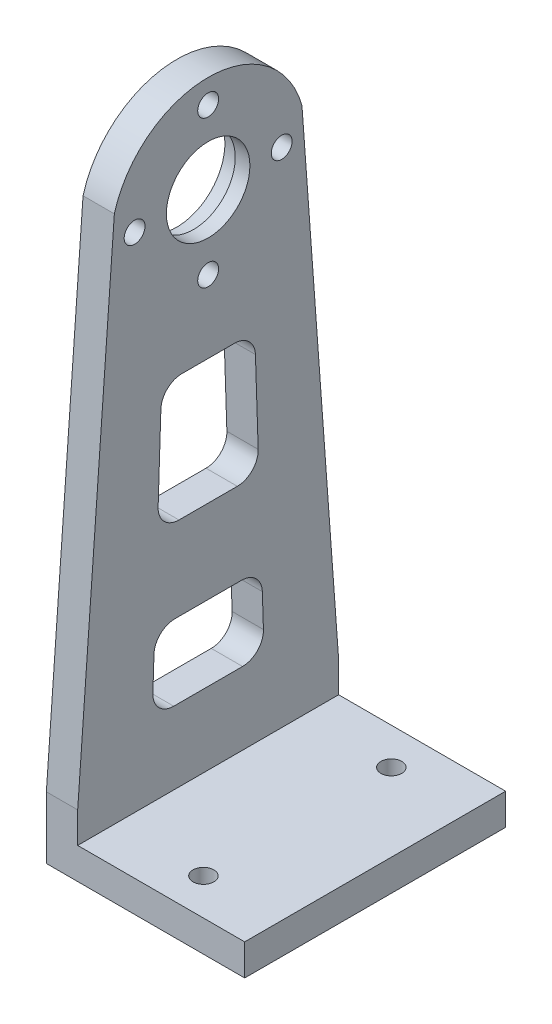
ISO-10303-21;
HEADER;
FILE_DESCRIPTION(('STEP AP214'),'2;1');
FILE_NAME('part.step','',(''),(''),'','','');
FILE_SCHEMA(('AUTOMOTIVE_DESIGN { 1 0 10303 214 1 1 1 1 }'));
ENDSEC;
DATA;
#1=APPLICATION_CONTEXT('core data for automotive mechanical design processes');
#2=APPLICATION_PROTOCOL_DEFINITION('international standard','automotive_design',2000,#1);
#3=PRODUCT_CONTEXT('',#1,'mechanical');
#4=PRODUCT('Part','Part','',(#3));
#5=PRODUCT_RELATED_PRODUCT_CATEGORY('part','',(#4));
#6=PRODUCT_DEFINITION_FORMATION('','',#4);
#7=PRODUCT_DEFINITION_CONTEXT('part definition',#1,'design');
#8=PRODUCT_DEFINITION('design','',#6,#7);
#9=PRODUCT_DEFINITION_SHAPE('','',#8);
#10=(LENGTH_UNIT() NAMED_UNIT(*) SI_UNIT(.MILLI.,.METRE.));
#11=(NAMED_UNIT(*) PLANE_ANGLE_UNIT() SI_UNIT($,.RADIAN.));
#12=(NAMED_UNIT(*) SI_UNIT($,.STERADIAN.) SOLID_ANGLE_UNIT());
#13=UNCERTAINTY_MEASURE_WITH_UNIT(LENGTH_MEASURE(1.E-05),#10,'distance_accuracy_value','');
#14=(GEOMETRIC_REPRESENTATION_CONTEXT(3) GLOBAL_UNCERTAINTY_ASSIGNED_CONTEXT((#13)) GLOBAL_UNIT_ASSIGNED_CONTEXT((#10,
#11,#12)) REPRESENTATION_CONTEXT('',''));
#15=CARTESIAN_POINT('',(0.,0.,0.));
#16=DIRECTION('',(0.,0.,1.));
#17=DIRECTION('',(1.,0.,0.));
#18=AXIS2_PLACEMENT_3D('',#15,#16,#17);
#19=CARTESIAN_POINT('',(15.5,-52.,0.));
#20=DIRECTION('',(-1.,0.,0.));
#21=DIRECTION('',(0.,0.,1.));
#22=AXIS2_PLACEMENT_3D('',#19,#20,#21);
#23=CYLINDRICAL_SURFACE('',#22,4.);
#24=CARTESIAN_POINT('',(16.5,-52.,0.));
#25=DIRECTION('',(-1.,0.,0.));
#26=DIRECTION('',(0.,0.,-1.));
#27=AXIS2_PLACEMENT_3D('',#24,#25,#26);
#28=CIRCLE('',#27,4.);
#29=CARTESIAN_POINT('',(16.5,-52.,-4.));
#30=VERTEX_POINT('',#29);
#31=EDGE_CURVE('E48',#30,#30,#28,.T.);
#32=ORIENTED_EDGE('',*,*,#31,.F.);
#33=EDGE_LOOP('',(#32));
#34=FACE_BOUND('',#33,.T.);
#35=CARTESIAN_POINT('',(15.1,-52.,0.));
#36=DIRECTION('',(-1.,0.,0.));
#37=DIRECTION('',(0.,0.,1.));
#38=AXIS2_PLACEMENT_3D('',#35,#36,#37);
#39=CIRCLE('',#38,4.);
#40=CARTESIAN_POINT('',(15.1,-52.,4.));
#41=VERTEX_POINT('',#40);
#42=EDGE_CURVE('E42',#41,#41,#39,.F.);
#43=ORIENTED_EDGE('',*,*,#42,.F.);
#44=EDGE_LOOP('',(#43));
#45=FACE_BOUND('',#44,.T.);
#46=ADVANCED_FACE('F39',(#34,#45),#23,.F.);
#47=CARTESIAN_POINT('',(16.5,-100.7,-12.5));
#48=DIRECTION('',(1.,0.,0.));
#49=DIRECTION('',(0.,-1.,0.));
#50=AXIS2_PLACEMENT_3D('',#47,#48,#49);
#51=PLANE('',#50);
#52=CARTESIAN_POINT('',(16.5,-59.0452123011725,1.54223501579341E-13));
#53=DIRECTION('',(-1.,0.,0.));
#54=DIRECTION('',(0.,0.,1.));
#55=AXIS2_PLACEMENT_3D('',#52,#53,#54);
#56=CIRCLE('',#55,1.);
#57=CARTESIAN_POINT('',(16.5,-59.0452123011725,1.00000000000015));
#58=VERTEX_POINT('',#57);
#59=EDGE_CURVE('E521',#58,#58,#56,.T.);
#60=ORIENTED_EDGE('',*,*,#59,.T.);
#61=EDGE_LOOP('',(#60));
#62=FACE_BOUND('',#61,.T.);
#63=CARTESIAN_POINT('',(16.5,-52.,7.04521230117253));
#64=DIRECTION('',(-1.,0.,0.));
#65=DIRECTION('',(0.,0.,1.));
#66=AXIS2_PLACEMENT_3D('',#63,#64,#65);
#67=CIRCLE('',#66,1.00000000000001);
#68=CARTESIAN_POINT('',(16.5,-52.,8.04521230117253));
#69=VERTEX_POINT('',#68);
#70=EDGE_CURVE('E527',#69,#69,#67,.T.);
#71=ORIENTED_EDGE('',*,*,#70,.T.);
#72=EDGE_LOOP('',(#71));
#73=FACE_BOUND('',#72,.T.);
#74=CARTESIAN_POINT('',(16.5,-52.0000000000001,-7.04521230117231));
#75=DIRECTION('',(-1.,0.,0.));
#76=DIRECTION('',(0.,0.,1.));
#77=AXIS2_PLACEMENT_3D('',#74,#75,#76);
#78=CIRCLE('',#77,1.);
#79=CARTESIAN_POINT('',(16.5,-52.0000000000001,-6.04521230117231));
#80=VERTEX_POINT('',#79);
#81=EDGE_CURVE('E533',#80,#80,#78,.T.);
#82=ORIENTED_EDGE('',*,*,#81,.T.);
#83=EDGE_LOOP('',(#82));
#84=FACE_BOUND('',#83,.T.);
#85=CARTESIAN_POINT('',(16.5,-44.9547876988277,0.));
#86=DIRECTION('',(-1.,0.,0.));
#87=DIRECTION('',(0.,0.,1.));
#88=AXIS2_PLACEMENT_3D('',#85,#86,#87);
#89=CIRCLE('',#88,1.);
#90=CARTESIAN_POINT('',(16.5,-44.9547876988277,1.00000000000001));
#91=VERTEX_POINT('',#90);
#92=EDGE_CURVE('E198',#91,#91,#89,.T.);
#93=ORIENTED_EDGE('',*,*,#92,.T.);
#94=EDGE_LOOP('',(#93));
#95=FACE_BOUND('',#94,.T.);
#96=DIRECTION('',(0.,-0.997297605701587,-0.0734675823876265));
#97=VECTOR('',#96,1.);
#98=CARTESIAN_POINT('',(16.5,-100.681108800183,-12.7564416540415));
#99=LINE('',#98,#97);
#100=CARTESIAN_POINT('',(16.5,-49.5,-8.986100377806));
#101=VERTEX_POINT('',#100);
#102=CARTESIAN_POINT('',(16.5,-97.2,-12.5));
#103=VERTEX_POINT('',#102);
#104=EDGE_CURVE('E173',#101,#103,#99,.T.);
#105=ORIENTED_EDGE('',*,*,#104,.F.);
#106=CARTESIAN_POINT('',(16.5,-52.0000000000001,0.));
#107=DIRECTION('',(1.,0.,0.));
#108=DIRECTION('',(0.,0.,-1.));
#109=AXIS2_PLACEMENT_3D('',#106,#107,#108);
#110=CIRCLE('',#109,9.32737905308911);
#111=CARTESIAN_POINT('',(16.5,-49.5,8.986100377806));
#112=VERTEX_POINT('',#111);
#113=EDGE_CURVE('E188',#101,#112,#110,.T.);
#114=ORIENTED_EDGE('',*,*,#113,.T.);
#115=DIRECTION('',(0.,0.997297605701587,-0.0734675823876265));
#116=VECTOR('',#115,1.);
#117=CARTESIAN_POINT('',(16.5,-98.8493826998868,12.6215045124945));
#118=LINE('',#117,#116);
#119=CARTESIAN_POINT('',(16.5,-97.2,12.5));
#120=VERTEX_POINT('',#119);
#121=EDGE_CURVE('E193',#120,#112,#118,.T.);
#122=ORIENTED_EDGE('',*,*,#121,.F.);
#123=DIRECTION('',(0.,1.,0.));
#124=VECTOR('',#123,1.);
#125=CARTESIAN_POINT('',(16.5,-100.7,12.5));
#126=LINE('',#125,#124);
#127=CARTESIAN_POINT('',(16.5,-100.149489742783,12.5));
#128=VERTEX_POINT('',#127);
#129=EDGE_CURVE('E153',#128,#120,#126,.T.);
#130=ORIENTED_EDGE('',*,*,#129,.F.);
#131=DIRECTION('',(0.,0.,1.));
#132=VECTOR('',#131,1.);
#133=CARTESIAN_POINT('',(16.5,-100.149489742783,12.5));
#134=LINE('',#133,#132);
#135=CARTESIAN_POINT('',(16.5,-100.149489742783,-12.5));
#136=VERTEX_POINT('',#135);
#137=EDGE_CURVE('E192',#136,#128,#134,.T.);
#138=ORIENTED_EDGE('',*,*,#137,.F.);
#139=DIRECTION('',(0.,1.,0.));
#140=VECTOR('',#139,1.);
#141=CARTESIAN_POINT('',(16.5,-100.7,-12.5));
#142=LINE('',#141,#140);
#143=EDGE_CURVE('E11',#136,#103,#142,.T.);
#144=ORIENTED_EDGE('',*,*,#143,.T.);
#145=EDGE_LOOP('',(#105,#114,#122,#130,#138,#144));
#146=FACE_BOUND('',#145,.T.);
#147=ORIENTED_EDGE('',*,*,#31,.T.);
#148=EDGE_LOOP('',(#147));
#149=FACE_BOUND('',#148,.T.);
#150=CARTESIAN_POINT('',(16.5,-91.2,-3.296767463509));
#151=DIRECTION('',(-1.,0.,0.));
#152=DIRECTION('',(0.,0.0330349000935773,-0.999454198738395));
#153=AXIS2_PLACEMENT_3D('',#150,#151,#152);
#154=CIRCLE('',#153,2.);
#155=CARTESIAN_POINT('',(16.5,-91.13393019981,-5.295675860986));
#156=VERTEX_POINT('',#155);
#157=CARTESIAN_POINT('',(16.5,-93.2,-3.296767463509));
#158=VERTEX_POINT('',#157);
#159=EDGE_CURVE('E260',#156,#158,#154,.T.);
#160=ORIENTED_EDGE('',*,*,#159,.T.);
#161=DIRECTION('',(0.,0.,-1.));
#162=VECTOR('',#161,1.);
#163=CARTESIAN_POINT('',(16.5,-93.2,3.296767463509));
#164=LINE('',#163,#162);
#165=CARTESIAN_POINT('',(16.5,-93.2,3.296767463509));
#166=VERTEX_POINT('',#165);
#167=EDGE_CURVE('E135',#166,#158,#164,.T.);
#168=ORIENTED_EDGE('',*,*,#167,.F.);
#169=CARTESIAN_POINT('',(16.5,-91.2,3.296767463509));
#170=DIRECTION('',(-1.,0.,0.));
#171=DIRECTION('',(0.,-1.,0.));
#172=AXIS2_PLACEMENT_3D('',#169,#170,#171);
#173=CIRCLE('',#172,2.);
#174=CARTESIAN_POINT('',(16.5,-91.13393019981,5.295675860986));
#175=VERTEX_POINT('',#174);
#176=EDGE_CURVE('E266',#166,#175,#173,.T.);
#177=ORIENTED_EDGE('',*,*,#176,.T.);
#178=DIRECTION('',(0.,-0.999454198738395,0.0330349000935798));
#179=VECTOR('',#178,1.);
#180=CARTESIAN_POINT('',(16.5,-87.93393019981,5.189906451609));
#181=LINE('',#180,#179);
#182=CARTESIAN_POINT('',(16.5,-87.93393019981,5.189906451609));
#183=VERTEX_POINT('',#182);
#184=EDGE_CURVE('E146',#183,#175,#181,.T.);
#185=ORIENTED_EDGE('',*,*,#184,.F.);
#186=CARTESIAN_POINT('',(16.5,-88.,3.190998054133));
#187=DIRECTION('',(-1.,0.,0.));
#188=DIRECTION('',(0.,0.0330349000935773,0.999454198738395));
#189=AXIS2_PLACEMENT_3D('',#186,#187,#188);
#190=CIRCLE('',#189,2.);
#191=CARTESIAN_POINT('',(16.5,-86.,3.190998054133));
#192=VERTEX_POINT('',#191);
#193=EDGE_CURVE('E127',#183,#192,#190,.T.);
#194=ORIENTED_EDGE('',*,*,#193,.T.);
#195=DIRECTION('',(0.,0.,1.));
#196=VECTOR('',#195,1.);
#197=CARTESIAN_POINT('',(16.5,-86.,-3.190998054133));
#198=LINE('',#197,#196);
#199=CARTESIAN_POINT('',(16.5,-86.,-3.190998054133));
#200=VERTEX_POINT('',#199);
#201=EDGE_CURVE('E102',#200,#192,#198,.T.);
#202=ORIENTED_EDGE('',*,*,#201,.F.);
#203=CARTESIAN_POINT('',(16.5,-88.,-3.190998054133));
#204=DIRECTION('',(-1.,0.,0.));
#205=DIRECTION('',(0.,1.,0.));
#206=AXIS2_PLACEMENT_3D('',#203,#204,#205);
#207=CIRCLE('',#206,2.);
#208=CARTESIAN_POINT('',(16.5,-87.93393019981,-5.189906451609));
#209=VERTEX_POINT('',#208);
#210=EDGE_CURVE('E121',#200,#209,#207,.T.);
#211=ORIENTED_EDGE('',*,*,#210,.T.);
#212=DIRECTION('',(0.,0.999454198738395,0.0330349000935798));
#213=VECTOR('',#212,1.);
#214=CARTESIAN_POINT('',(16.5,-91.13393019981,-5.295675860986));
#215=LINE('',#214,#213);
#216=EDGE_CURVE('E108',#156,#209,#215,.T.);
#217=ORIENTED_EDGE('',*,*,#216,.F.);
#218=EDGE_LOOP('',(#160,#168,#177,#185,#194,#202,#211,#217));
#219=FACE_BOUND('',#218,.T.);
#220=CARTESIAN_POINT('',(16.5,-68.,-2.529939245529));
#221=DIRECTION('',(-1.,0.,0.));
#222=DIRECTION('',(0.,1.,0.));
#223=AXIS2_PLACEMENT_3D('',#220,#221,#222);
#224=CIRCLE('',#223,2.);
#225=CARTESIAN_POINT('',(16.5,-66.,-2.529939245529));
#226=VERTEX_POINT('',#225);
#227=CARTESIAN_POINT('',(16.5,-67.93393019981,-4.528847643006));
#228=VERTEX_POINT('',#227);
#229=EDGE_CURVE('E240',#226,#228,#224,.T.);
#230=ORIENTED_EDGE('',*,*,#229,.T.);
#231=DIRECTION('',(0.,0.999454198738395,0.0330349000935798));
#232=VECTOR('',#231,1.);
#233=CARTESIAN_POINT('',(16.5,-75.93393019981,-4.793271166447));
#234=LINE('',#233,#232);
#235=CARTESIAN_POINT('',(16.5,-75.93393019981,-4.793271166447));
#236=VERTEX_POINT('',#235);
#237=EDGE_CURVE('E57',#236,#228,#234,.T.);
#238=ORIENTED_EDGE('',*,*,#237,.F.);
#239=CARTESIAN_POINT('',(16.5,-76.,-2.794362768971));
#240=DIRECTION('',(-1.,0.,0.));
#241=DIRECTION('',(0.,0.0330349000935773,-0.999454198738395));
#242=AXIS2_PLACEMENT_3D('',#239,#240,#241);
#243=CIRCLE('',#242,2.);
#244=CARTESIAN_POINT('',(16.5,-78.,-2.794362768971));
#245=VERTEX_POINT('',#244);
#246=EDGE_CURVE('E242',#236,#245,#243,.T.);
#247=ORIENTED_EDGE('',*,*,#246,.T.);
#248=DIRECTION('',(0.,0.,-1.));
#249=VECTOR('',#248,1.);
#250=CARTESIAN_POINT('',(16.5,-78.,2.794362768971));
#251=LINE('',#250,#249);
#252=CARTESIAN_POINT('',(16.5,-78.,2.794362768971));
#253=VERTEX_POINT('',#252);
#254=EDGE_CURVE('E249',#253,#245,#251,.T.);
#255=ORIENTED_EDGE('',*,*,#254,.F.);
#256=CARTESIAN_POINT('',(16.5,-76.,2.794362768971));
#257=DIRECTION('',(-1.,0.,0.));
#258=DIRECTION('',(0.,-1.,0.));
#259=AXIS2_PLACEMENT_3D('',#256,#257,#258);
#260=CIRCLE('',#259,2.);
#261=CARTESIAN_POINT('',(16.5,-75.93393019981,4.793271166447));
#262=VERTEX_POINT('',#261);
#263=EDGE_CURVE('E248',#253,#262,#260,.T.);
#264=ORIENTED_EDGE('',*,*,#263,.T.);
#265=DIRECTION('',(0.,-0.999454198738395,0.0330349000935798));
#266=VECTOR('',#265,1.);
#267=CARTESIAN_POINT('',(16.5,-67.93393019981,4.528847643006));
#268=LINE('',#267,#266);
#269=CARTESIAN_POINT('',(16.5,-67.93393019981,4.528847643006));
#270=VERTEX_POINT('',#269);
#271=EDGE_CURVE('E128',#270,#262,#268,.T.);
#272=ORIENTED_EDGE('',*,*,#271,.F.);
#273=CARTESIAN_POINT('',(16.5,-68.,2.529939245529));
#274=DIRECTION('',(-1.,0.,0.));
#275=DIRECTION('',(0.,0.0330349000935773,0.999454198738395));
#276=AXIS2_PLACEMENT_3D('',#273,#274,#275);
#277=CIRCLE('',#276,2.);
#278=CARTESIAN_POINT('',(16.5,-66.,2.529939245529));
#279=VERTEX_POINT('',#278);
#280=EDGE_CURVE('E255',#270,#279,#277,.T.);
#281=ORIENTED_EDGE('',*,*,#280,.T.);
#282=DIRECTION('',(0.,0.,1.));
#283=VECTOR('',#282,1.);
#284=CARTESIAN_POINT('',(16.5,-66.,-2.529939245529));
#285=LINE('',#284,#283);
#286=EDGE_CURVE('E261',#226,#279,#285,.T.);
#287=ORIENTED_EDGE('',*,*,#286,.F.);
#288=EDGE_LOOP('',(#230,#238,#247,#255,#264,#272,#281,#287));
#289=FACE_BOUND('',#288,.T.);
#290=ADVANCED_FACE('F122',(#62,#73,#84,#95,#146,#149,#219,#289),#51,.T.);
#291=CARTESIAN_POINT('',(15.5,-70.85,12.5));
#292=DIRECTION('',(0.,0.,-1.));
#293=DIRECTION('',(0.,-1.,0.));
#294=AXIS2_PLACEMENT_3D('',#291,#292,#293);
#295=PLANE('',#294);
#296=DIRECTION('',(-1.,0.,0.));
#297=VECTOR('',#296,1.);
#298=CARTESIAN_POINT('',(32.5,-100.149489742783,12.5));
#299=LINE('',#298,#297);
#300=CARTESIAN_POINT('',(32.5,-100.149489742783,12.5));
#301=VERTEX_POINT('',#300);
#302=EDGE_CURVE('E223',#301,#128,#299,.T.);
#303=ORIENTED_EDGE('',*,*,#302,.T.);
#304=ORIENTED_EDGE('',*,*,#129,.T.);
#305=DIRECTION('',(-1.,0.,0.));
#306=VECTOR('',#305,1.);
#307=CARTESIAN_POINT('',(16.5,-97.2,12.5));
#308=LINE('',#307,#306);
#309=CARTESIAN_POINT('',(13.5,-97.2,12.5));
#310=VERTEX_POINT('',#309);
#311=EDGE_CURVE('E159',#120,#310,#308,.T.);
#312=ORIENTED_EDGE('',*,*,#311,.T.);
#313=DIRECTION('',(0.,-1.,0.));
#314=VECTOR('',#313,1.);
#315=CARTESIAN_POINT('',(13.5,0.,12.5));
#316=LINE('',#315,#314);
#317=CARTESIAN_POINT('',(13.5,-103.149489742783,12.5));
#318=VERTEX_POINT('',#317);
#319=EDGE_CURVE('E385',#310,#318,#316,.T.);
#320=ORIENTED_EDGE('',*,*,#319,.T.);
#321=DIRECTION('',(-1.,0.,0.));
#322=VECTOR('',#321,1.);
#323=CARTESIAN_POINT('',(75.6884089130718,-103.149489742783,12.5));
#324=LINE('',#323,#322);
#325=CARTESIAN_POINT('',(32.5,-103.149489742783,12.5));
#326=VERTEX_POINT('',#325);
#327=EDGE_CURVE('E231',#326,#318,#324,.T.);
#328=ORIENTED_EDGE('',*,*,#327,.F.);
#329=DIRECTION('',(0.,-1.,0.));
#330=VECTOR('',#329,1.);
#331=CARTESIAN_POINT('',(32.5,-103.149489742783,12.5));
#332=LINE('',#331,#330);
#333=EDGE_CURVE('E211',#301,#326,#332,.T.);
#334=ORIENTED_EDGE('',*,*,#333,.F.);
#335=EDGE_LOOP('',(#303,#304,#312,#320,#328,#334));
#336=FACE_BOUND('',#335,.T.);
#337=ADVANCED_FACE('F376',(#336),#295,.F.);
#338=CARTESIAN_POINT('',(15.93933982822,-101.76066017178,-12.5));
#339=DIRECTION('',(0.,0.,-1.));
#340=DIRECTION('',(1.,0.,0.));
#341=AXIS2_PLACEMENT_3D('',#338,#339,#340);
#342=PLANE('',#341);
#343=DIRECTION('',(-1.,0.,0.));
#344=VECTOR('',#343,1.);
#345=CARTESIAN_POINT('',(75.6884089130718,-103.149489742783,-12.5));
#346=LINE('',#345,#344);
#347=CARTESIAN_POINT('',(32.5,-103.149489742783,-12.5));
#348=VERTEX_POINT('',#347);
#349=CARTESIAN_POINT('',(13.5,-103.149489742783,-12.5));
#350=VERTEX_POINT('',#349);
#351=EDGE_CURVE('E158',#348,#350,#346,.T.);
#352=ORIENTED_EDGE('',*,*,#351,.T.);
#353=DIRECTION('',(0.,1.,0.));
#354=VECTOR('',#353,1.);
#355=CARTESIAN_POINT('',(13.5,0.,-12.5));
#356=LINE('',#355,#354);
#357=CARTESIAN_POINT('',(13.5,-97.2,-12.5));
#358=VERTEX_POINT('',#357);
#359=EDGE_CURVE('E393',#350,#358,#356,.T.);
#360=ORIENTED_EDGE('',*,*,#359,.T.);
#361=DIRECTION('',(-1.,0.,0.));
#362=VECTOR('',#361,1.);
#363=CARTESIAN_POINT('',(16.5,-97.2,-12.5));
#364=LINE('',#363,#362);
#365=EDGE_CURVE('E162',#103,#358,#364,.T.);
#366=ORIENTED_EDGE('',*,*,#365,.F.);
#367=ORIENTED_EDGE('',*,*,#143,.F.);
#368=DIRECTION('',(-1.,0.,0.));
#369=VECTOR('',#368,1.);
#370=CARTESIAN_POINT('',(32.5,-100.149489742783,-12.5));
#371=LINE('',#370,#369);
#372=CARTESIAN_POINT('',(32.5,-100.149489742783,-12.5));
#373=VERTEX_POINT('',#372);
#374=EDGE_CURVE('E228',#373,#136,#371,.T.);
#375=ORIENTED_EDGE('',*,*,#374,.F.);
#376=DIRECTION('',(0.,1.,0.));
#377=VECTOR('',#376,1.);
#378=CARTESIAN_POINT('',(32.5,-100.149489742783,-12.5));
#379=LINE('',#378,#377);
#380=EDGE_CURVE('E217',#348,#373,#379,.T.);
#381=ORIENTED_EDGE('',*,*,#380,.F.);
#382=EDGE_LOOP('',(#352,#360,#366,#367,#375,#381));
#383=FACE_BOUND('',#382,.T.);
#384=ADVANCED_FACE('F478',(#383),#342,.T.);
#385=CARTESIAN_POINT('',(15.5,-72.,4.663243205897));
#386=DIRECTION('',(0.,0.0330349000935798,0.999454198738395));
#387=DIRECTION('',(0.,0.999454198738395,-0.0330349000935798));
#388=AXIS2_PLACEMENT_3D('',#385,#386,#387);
#389=PLANE('',#388);
#390=ORIENTED_EDGE('',*,*,#271,.T.);
#391=DIRECTION('',(-1.,0.,0.));
#392=VECTOR('',#391,1.);
#393=CARTESIAN_POINT('',(16.5,-75.93393019981,4.793271166447));
#394=LINE('',#393,#392);
#395=CARTESIAN_POINT('',(13.5,-75.93393019981,4.79327116644733));
#396=VERTEX_POINT('',#395);
#397=EDGE_CURVE('E257',#262,#396,#394,.T.);
#398=ORIENTED_EDGE('',*,*,#397,.T.);
#399=DIRECTION('',(0.,0.999454198738395,-0.0330349000935798));
#400=VECTOR('',#399,1.);
#401=CARTESIAN_POINT('',(13.5,0.0753917599162948,2.28093957557516));
#402=LINE('',#401,#400);
#403=CARTESIAN_POINT('',(13.5,-67.93393019981,4.5288476430057));
#404=VERTEX_POINT('',#403);
#405=EDGE_CURVE('E328',#396,#404,#402,.T.);
#406=ORIENTED_EDGE('',*,*,#405,.T.);
#407=DIRECTION('',(-1.,0.,0.));
#408=VECTOR('',#407,1.);
#409=CARTESIAN_POINT('',(16.5,-67.93393019981,4.528847643006));
#410=LINE('',#409,#408);
#411=EDGE_CURVE('E263',#270,#404,#410,.T.);
#412=ORIENTED_EDGE('',*,*,#411,.F.);
#413=EDGE_LOOP('',(#390,#398,#406,#412));
#414=FACE_BOUND('',#413,.T.);
#415=ADVANCED_FACE('F476',(#414),#389,.F.);
#416=CARTESIAN_POINT('',(118.162,-68.,2.529939245529));
#417=DIRECTION('',(-1.,0.,0.));
#418=DIRECTION('',(0.,-0.0330349000935773,-0.999454198738395));
#419=AXIS2_PLACEMENT_3D('',#416,#417,#418);
#420=CYLINDRICAL_SURFACE('',#419,2.);
#421=ORIENTED_EDGE('',*,*,#411,.T.);
#422=CARTESIAN_POINT('',(13.5,-68.,2.529939245529));
#423=DIRECTION('',(1.,0.,0.));
#424=DIRECTION('',(0.,0.,-1.));
#425=AXIS2_PLACEMENT_3D('',#422,#423,#424);
#426=CIRCLE('',#425,2.);
#427=CARTESIAN_POINT('',(13.5,-66.,2.529939245529));
#428=VERTEX_POINT('',#427);
#429=EDGE_CURVE('E207',#404,#428,#426,.F.);
#430=ORIENTED_EDGE('',*,*,#429,.T.);
#431=DIRECTION('',(-1.,0.,0.));
#432=VECTOR('',#431,1.);
#433=CARTESIAN_POINT('',(16.5,-66.,2.529939245529));
#434=LINE('',#433,#432);
#435=EDGE_CURVE('E264',#279,#428,#434,.T.);
#436=ORIENTED_EDGE('',*,*,#435,.F.);
#437=ORIENTED_EDGE('',*,*,#280,.F.);
#438=EDGE_LOOP('',(#421,#430,#436,#437));
#439=FACE_BOUND('',#438,.T.);
#440=ADVANCED_FACE('F339',(#439),#420,.F.);
#441=CARTESIAN_POINT('',(15.5,-66.,0.));
#442=DIRECTION('',(0.,1.,0.));
#443=DIRECTION('',(0.,0.,-1.));
#444=AXIS2_PLACEMENT_3D('',#441,#442,#443);
#445=PLANE('',#444);
#446=ORIENTED_EDGE('',*,*,#286,.T.);
#447=ORIENTED_EDGE('',*,*,#435,.T.);
#448=DIRECTION('',(0.,0.,-1.));
#449=VECTOR('',#448,1.);
#450=CARTESIAN_POINT('',(13.5,-66.,0.));
#451=LINE('',#450,#449);
#452=CARTESIAN_POINT('',(13.5,-66.,-2.529939245529));
#453=VERTEX_POINT('',#452);
#454=EDGE_CURVE('E308',#428,#453,#451,.T.);
#455=ORIENTED_EDGE('',*,*,#454,.T.);
#456=DIRECTION('',(-1.,0.,0.));
#457=VECTOR('',#456,1.);
#458=CARTESIAN_POINT('',(16.5,-66.,-2.529939245529));
#459=LINE('',#458,#457);
#460=EDGE_CURVE('E244',#226,#453,#459,.T.);
#461=ORIENTED_EDGE('',*,*,#460,.F.);
#462=EDGE_LOOP('',(#446,#447,#455,#461));
#463=FACE_BOUND('',#462,.T.);
#464=ADVANCED_FACE('F474',(#463),#445,.F.);
#465=CARTESIAN_POINT('',(118.162,-68.,-2.529939245529));
#466=DIRECTION('',(-1.,0.,0.));
#467=DIRECTION('',(0.,-1.,0.));
#468=AXIS2_PLACEMENT_3D('',#465,#466,#467);
#469=CYLINDRICAL_SURFACE('',#468,2.);
#470=ORIENTED_EDGE('',*,*,#460,.T.);
#471=CARTESIAN_POINT('',(13.5,-68.,-2.529939245529));
#472=DIRECTION('',(1.,0.,0.));
#473=DIRECTION('',(0.,0.,-1.));
#474=AXIS2_PLACEMENT_3D('',#471,#472,#473);
#475=CIRCLE('',#474,2.);
#476=CARTESIAN_POINT('',(13.5,-67.93393019981,-4.52884764300567));
#477=VERTEX_POINT('',#476);
#478=EDGE_CURVE('E311',#453,#477,#475,.F.);
#479=ORIENTED_EDGE('',*,*,#478,.T.);
#480=DIRECTION('',(-1.,0.,0.));
#481=VECTOR('',#480,1.);
#482=CARTESIAN_POINT('',(16.5,-67.93393019981,-4.528847643006));
#483=LINE('',#482,#481);
#484=EDGE_CURVE('E245',#228,#477,#483,.T.);
#485=ORIENTED_EDGE('',*,*,#484,.F.);
#486=ORIENTED_EDGE('',*,*,#229,.F.);
#487=EDGE_LOOP('',(#470,#479,#485,#486));
#488=FACE_BOUND('',#487,.T.);
#489=ADVANCED_FACE('F471',(#488),#469,.F.);
#490=CARTESIAN_POINT('',(15.5,-72.,-4.663243205897));
#491=DIRECTION('',(0.,0.0330349000935798,-0.999454198738395));
#492=DIRECTION('',(0.,-0.999454198738395,-0.0330349000935798));
#493=AXIS2_PLACEMENT_3D('',#490,#491,#492);
#494=PLANE('',#493);
#495=ORIENTED_EDGE('',*,*,#484,.T.);
#496=DIRECTION('',(0.,-0.999454198738395,-0.0330349000935798));
#497=VECTOR('',#496,1.);
#498=CARTESIAN_POINT('',(13.5,0.0753917599162838,-2.28093957557483));
#499=LINE('',#498,#497);
#500=CARTESIAN_POINT('',(13.5,-75.9339301998128,-4.79327116644779));
#501=VERTEX_POINT('',#500);
#502=EDGE_CURVE('E317',#477,#501,#499,.T.);
#503=ORIENTED_EDGE('',*,*,#502,.T.);
#504=DIRECTION('',(-1.,0.,0.));
#505=VECTOR('',#504,1.);
#506=CARTESIAN_POINT('',(16.5,-75.93393019981,-4.793271166447));
#507=LINE('',#506,#505);
#508=EDGE_CURVE('E251',#236,#501,#507,.T.);
#509=ORIENTED_EDGE('',*,*,#508,.F.);
#510=ORIENTED_EDGE('',*,*,#237,.T.);
#511=EDGE_LOOP('',(#495,#503,#509,#510));
#512=FACE_BOUND('',#511,.T.);
#513=ADVANCED_FACE('F467',(#512),#494,.F.);
#514=CARTESIAN_POINT('',(118.162,-76.,-2.794362768971));
#515=DIRECTION('',(-1.,0.,0.));
#516=DIRECTION('',(0.,-0.0330349000935773,0.999454198738395));
#517=AXIS2_PLACEMENT_3D('',#514,#515,#516);
#518=CYLINDRICAL_SURFACE('',#517,2.);
#519=ORIENTED_EDGE('',*,*,#508,.T.);
#520=CARTESIAN_POINT('',(13.5,-76.,-2.794362768971));
#521=DIRECTION('',(1.,0.,0.));
#522=DIRECTION('',(0.,0.,-1.));
#523=AXIS2_PLACEMENT_3D('',#520,#521,#522);
#524=CIRCLE('',#523,2.);
#525=CARTESIAN_POINT('',(13.5,-78.,-2.794362768971));
#526=VERTEX_POINT('',#525);
#527=EDGE_CURVE('E320',#501,#526,#524,.F.);
#528=ORIENTED_EDGE('',*,*,#527,.T.);
#529=DIRECTION('',(-1.,0.,0.));
#530=VECTOR('',#529,1.);
#531=CARTESIAN_POINT('',(16.5,-78.,-2.794362768971));
#532=LINE('',#531,#530);
#533=EDGE_CURVE('E252',#245,#526,#532,.T.);
#534=ORIENTED_EDGE('',*,*,#533,.F.);
#535=ORIENTED_EDGE('',*,*,#246,.F.);
#536=EDGE_LOOP('',(#519,#528,#534,#535));
#537=FACE_BOUND('',#536,.T.);
#538=ADVANCED_FACE('F465',(#537),#518,.F.);
#539=CARTESIAN_POINT('',(15.5,-78.,0.));
#540=DIRECTION('',(0.,-1.,0.));
#541=DIRECTION('',(0.,0.,1.));
#542=AXIS2_PLACEMENT_3D('',#539,#540,#541);
#543=PLANE('',#542);
#544=ORIENTED_EDGE('',*,*,#254,.T.);
#545=ORIENTED_EDGE('',*,*,#533,.T.);
#546=DIRECTION('',(0.,0.,1.));
#547=VECTOR('',#546,1.);
#548=CARTESIAN_POINT('',(13.5,-78.,0.));
#549=LINE('',#548,#547);
#550=CARTESIAN_POINT('',(13.5,-78.,2.794362768971));
#551=VERTEX_POINT('',#550);
#552=EDGE_CURVE('E323',#526,#551,#549,.T.);
#553=ORIENTED_EDGE('',*,*,#552,.T.);
#554=DIRECTION('',(-1.,0.,0.));
#555=VECTOR('',#554,1.);
#556=CARTESIAN_POINT('',(16.5,-78.,2.794362768971));
#557=LINE('',#556,#555);
#558=EDGE_CURVE('E272',#253,#551,#557,.T.);
#559=ORIENTED_EDGE('',*,*,#558,.F.);
#560=EDGE_LOOP('',(#544,#545,#553,#559));
#561=FACE_BOUND('',#560,.T.);
#562=ADVANCED_FACE('F461',(#561),#543,.F.);
#563=CARTESIAN_POINT('',(118.162,-76.,2.794362768971));
#564=DIRECTION('',(-1.,0.,0.));
#565=DIRECTION('',(0.,1.,0.));
#566=AXIS2_PLACEMENT_3D('',#563,#564,#565);
#567=CYLINDRICAL_SURFACE('',#566,2.);
#568=ORIENTED_EDGE('',*,*,#558,.T.);
#569=CARTESIAN_POINT('',(13.5,-76.,2.794362768971));
#570=DIRECTION('',(1.,0.,0.));
#571=DIRECTION('',(0.,0.,-1.));
#572=AXIS2_PLACEMENT_3D('',#569,#570,#571);
#573=CIRCLE('',#572,2.);
#574=EDGE_CURVE('E326',#551,#396,#573,.F.);
#575=ORIENTED_EDGE('',*,*,#574,.T.);
#576=ORIENTED_EDGE('',*,*,#397,.F.);
#577=ORIENTED_EDGE('',*,*,#263,.F.);
#578=EDGE_LOOP('',(#568,#575,#576,#577));
#579=FACE_BOUND('',#578,.T.);
#580=ADVANCED_FACE('F456',(#579),#567,.F.);
#581=CARTESIAN_POINT('',(15.5,-86.,0.));
#582=DIRECTION('',(0.,1.,0.));
#583=DIRECTION('',(0.,0.,-1.));
#584=AXIS2_PLACEMENT_3D('',#581,#582,#583);
#585=PLANE('',#584);
#586=ORIENTED_EDGE('',*,*,#201,.T.);
#587=DIRECTION('',(-1.,0.,0.));
#588=VECTOR('',#587,1.);
#589=CARTESIAN_POINT('',(16.5,-86.,3.190998054133));
#590=LINE('',#589,#588);
#591=CARTESIAN_POINT('',(13.5,-86.,3.190998054133));
#592=VERTEX_POINT('',#591);
#593=EDGE_CURVE('E273',#192,#592,#590,.T.);
#594=ORIENTED_EDGE('',*,*,#593,.T.);
#595=DIRECTION('',(0.,0.,-1.));
#596=VECTOR('',#595,1.);
#597=CARTESIAN_POINT('',(13.5,-86.,0.));
#598=LINE('',#597,#596);
#599=CARTESIAN_POINT('',(13.5,-86.,-3.190998054133));
#600=VERTEX_POINT('',#599);
#601=EDGE_CURVE('E297',#592,#600,#598,.T.);
#602=ORIENTED_EDGE('',*,*,#601,.T.);
#603=DIRECTION('',(-1.,0.,0.));
#604=VECTOR('',#603,1.);
#605=CARTESIAN_POINT('',(16.5,-86.,-3.190998054133));
#606=LINE('',#605,#604);
#607=EDGE_CURVE('E119',#200,#600,#606,.T.);
#608=ORIENTED_EDGE('',*,*,#607,.F.);
#609=EDGE_LOOP('',(#586,#594,#602,#608));
#610=FACE_BOUND('',#609,.T.);
#611=ADVANCED_FACE('F298',(#610),#585,.F.);
#612=CARTESIAN_POINT('',(118.162,-88.,-3.190998054133));
#613=DIRECTION('',(-1.,0.,0.));
#614=DIRECTION('',(0.,-1.,0.));
#615=AXIS2_PLACEMENT_3D('',#612,#613,#614);
#616=CYLINDRICAL_SURFACE('',#615,2.);
#617=ORIENTED_EDGE('',*,*,#607,.T.);
#618=CARTESIAN_POINT('',(13.5,-88.,-3.190998054133));
#619=DIRECTION('',(1.,0.,0.));
#620=DIRECTION('',(0.,0.,-1.));
#621=AXIS2_PLACEMENT_3D('',#618,#619,#620);
#622=CIRCLE('',#621,2.);
#623=CARTESIAN_POINT('',(13.5,-87.93393019981,-5.18990645160947));
#624=VERTEX_POINT('',#623);
#625=EDGE_CURVE('E133',#600,#624,#622,.F.);
#626=ORIENTED_EDGE('',*,*,#625,.T.);
#627=DIRECTION('',(-1.,0.,0.));
#628=VECTOR('',#627,1.);
#629=CARTESIAN_POINT('',(16.5,-87.93393019981,-5.189906451609));
#630=LINE('',#629,#628);
#631=EDGE_CURVE('E113',#209,#624,#630,.T.);
#632=ORIENTED_EDGE('',*,*,#631,.F.);
#633=ORIENTED_EDGE('',*,*,#210,.F.);
#634=EDGE_LOOP('',(#617,#626,#632,#633));
#635=FACE_BOUND('',#634,.T.);
#636=ADVANCED_FACE('F131',(#635),#616,.F.);
#637=CARTESIAN_POINT('',(15.5,-89.6,-5.244974957468));
#638=DIRECTION('',(0.,0.0330349000935798,-0.999454198738395));
#639=DIRECTION('',(0.,-0.999454198738395,-0.0330349000935798));
#640=AXIS2_PLACEMENT_3D('',#637,#638,#639);
#641=PLANE('',#640);
#642=ORIENTED_EDGE('',*,*,#631,.T.);
#643=DIRECTION('',(0.,-0.999454198738395,-0.0330349000935798));
#644=VECTOR('',#643,1.);
#645=CARTESIAN_POINT('',(13.5,0.0753917599162994,-2.2809395755753));
#646=LINE('',#645,#644);
#647=CARTESIAN_POINT('',(13.5,-91.13393019981,-5.295675860986));
#648=VERTEX_POINT('',#647);
#649=EDGE_CURVE('E307',#624,#648,#646,.T.);
#650=ORIENTED_EDGE('',*,*,#649,.T.);
#651=DIRECTION('',(-1.,0.,0.));
#652=VECTOR('',#651,1.);
#653=CARTESIAN_POINT('',(16.5,-91.13393019981,-5.295675860986));
#654=LINE('',#653,#652);
#655=EDGE_CURVE('E116',#156,#648,#654,.T.);
#656=ORIENTED_EDGE('',*,*,#655,.F.);
#657=ORIENTED_EDGE('',*,*,#216,.T.);
#658=EDGE_LOOP('',(#642,#650,#656,#657));
#659=FACE_BOUND('',#658,.T.);
#660=ADVANCED_FACE('F109',(#659),#641,.F.);
#661=CARTESIAN_POINT('',(118.162,-91.2,-3.296767463509));
#662=DIRECTION('',(-1.,0.,0.));
#663=DIRECTION('',(0.,-0.0330349000935773,0.999454198738395));
#664=AXIS2_PLACEMENT_3D('',#661,#662,#663);
#665=CYLINDRICAL_SURFACE('',#664,2.);
#666=ORIENTED_EDGE('',*,*,#655,.T.);
#667=CARTESIAN_POINT('',(13.5,-91.2,-3.296767463509));
#668=DIRECTION('',(1.,0.,0.));
#669=DIRECTION('',(0.,0.,-1.));
#670=AXIS2_PLACEMENT_3D('',#667,#668,#669);
#671=CIRCLE('',#670,2.);
#672=CARTESIAN_POINT('',(13.5,-93.2,-3.296767463509));
#673=VERTEX_POINT('',#672);
#674=EDGE_CURVE('E401',#648,#673,#671,.F.);
#675=ORIENTED_EDGE('',*,*,#674,.T.);
#676=DIRECTION('',(-1.,0.,0.));
#677=VECTOR('',#676,1.);
#678=CARTESIAN_POINT('',(16.5,-93.2,-3.296767463509));
#679=LINE('',#678,#677);
#680=EDGE_CURVE('E140',#158,#673,#679,.T.);
#681=ORIENTED_EDGE('',*,*,#680,.F.);
#682=ORIENTED_EDGE('',*,*,#159,.F.);
#683=EDGE_LOOP('',(#666,#675,#681,#682));
#684=FACE_BOUND('',#683,.T.);
#685=ADVANCED_FACE('F440',(#684),#665,.F.);
#686=CARTESIAN_POINT('',(15.5,-93.2,0.));
#687=DIRECTION('',(0.,-1.,0.));
#688=DIRECTION('',(0.,0.,1.));
#689=AXIS2_PLACEMENT_3D('',#686,#687,#688);
#690=PLANE('',#689);
#691=ORIENTED_EDGE('',*,*,#167,.T.);
#692=ORIENTED_EDGE('',*,*,#680,.T.);
#693=DIRECTION('',(0.,0.,1.));
#694=VECTOR('',#693,1.);
#695=CARTESIAN_POINT('',(13.5,-93.2,0.));
#696=LINE('',#695,#694);
#697=CARTESIAN_POINT('',(13.5,-93.2,3.296767463509));
#698=VERTEX_POINT('',#697);
#699=EDGE_CURVE('E404',#673,#698,#696,.T.);
#700=ORIENTED_EDGE('',*,*,#699,.T.);
#701=DIRECTION('',(-1.,0.,0.));
#702=VECTOR('',#701,1.);
#703=CARTESIAN_POINT('',(16.5,-93.2,3.296767463509));
#704=LINE('',#703,#702);
#705=EDGE_CURVE('E143',#166,#698,#704,.T.);
#706=ORIENTED_EDGE('',*,*,#705,.F.);
#707=EDGE_LOOP('',(#691,#692,#700,#706));
#708=FACE_BOUND('',#707,.T.);
#709=ADVANCED_FACE('F435',(#708),#690,.F.);
#710=CARTESIAN_POINT('',(118.162,-91.2,3.296767463509));
#711=DIRECTION('',(-1.,0.,0.));
#712=DIRECTION('',(0.,1.,0.));
#713=AXIS2_PLACEMENT_3D('',#710,#711,#712);
#714=CYLINDRICAL_SURFACE('',#713,2.);
#715=ORIENTED_EDGE('',*,*,#705,.T.);
#716=CARTESIAN_POINT('',(13.5,-91.2,3.296767463509));
#717=DIRECTION('',(1.,0.,0.));
#718=DIRECTION('',(0.,0.,-1.));
#719=AXIS2_PLACEMENT_3D('',#716,#717,#718);
#720=CIRCLE('',#719,2.);
#721=CARTESIAN_POINT('',(13.5,-91.13393019981,5.29567586098553));
#722=VERTEX_POINT('',#721);
#723=EDGE_CURVE('E407',#698,#722,#720,.F.);
#724=ORIENTED_EDGE('',*,*,#723,.T.);
#725=DIRECTION('',(-1.,0.,0.));
#726=VECTOR('',#725,1.);
#727=CARTESIAN_POINT('',(16.5,-91.13393019981,5.295675860986));
#728=LINE('',#727,#726);
#729=EDGE_CURVE('E147',#175,#722,#728,.T.);
#730=ORIENTED_EDGE('',*,*,#729,.F.);
#731=ORIENTED_EDGE('',*,*,#176,.F.);
#732=EDGE_LOOP('',(#715,#724,#730,#731));
#733=FACE_BOUND('',#732,.T.);
#734=ADVANCED_FACE('F429',(#733),#714,.F.);
#735=CARTESIAN_POINT('',(15.5,-89.6,5.244974957468));
#736=DIRECTION('',(0.,0.0330349000935798,0.999454198738395));
#737=DIRECTION('',(0.,0.999454198738395,-0.0330349000935798));
#738=AXIS2_PLACEMENT_3D('',#735,#736,#737);
#739=PLANE('',#738);
#740=ORIENTED_EDGE('',*,*,#184,.T.);
#741=ORIENTED_EDGE('',*,*,#729,.T.);
#742=DIRECTION('',(0.,0.999454198738395,-0.0330349000935798));
#743=VECTOR('',#742,1.);
#744=CARTESIAN_POINT('',(13.5,0.075391759916284,2.28093957557484));
#745=LINE('',#744,#743);
#746=CARTESIAN_POINT('',(13.5,-87.93393019981,5.1899064516097));
#747=VERTEX_POINT('',#746);
#748=EDGE_CURVE('E410',#722,#747,#745,.T.);
#749=ORIENTED_EDGE('',*,*,#748,.T.);
#750=DIRECTION('',(-1.,0.,0.));
#751=VECTOR('',#750,1.);
#752=CARTESIAN_POINT('',(16.5,-87.93393019981,5.189906451609));
#753=LINE('',#752,#751);
#754=EDGE_CURVE('E150',#183,#747,#753,.T.);
#755=ORIENTED_EDGE('',*,*,#754,.F.);
#756=EDGE_LOOP('',(#740,#741,#749,#755));
#757=FACE_BOUND('',#756,.T.);
#758=ADVANCED_FACE('F423',(#757),#739,.F.);
#759=CARTESIAN_POINT('',(118.162,-88.,3.190998054133));
#760=DIRECTION('',(-1.,0.,0.));
#761=DIRECTION('',(0.,-0.0330349000935773,-0.999454198738395));
#762=AXIS2_PLACEMENT_3D('',#759,#760,#761);
#763=CYLINDRICAL_SURFACE('',#762,2.);
#764=ORIENTED_EDGE('',*,*,#754,.T.);
#765=CARTESIAN_POINT('',(13.5,-88.,3.190998054133));
#766=DIRECTION('',(1.,0.,0.));
#767=DIRECTION('',(0.,0.,-1.));
#768=AXIS2_PLACEMENT_3D('',#765,#766,#767);
#769=CIRCLE('',#768,2.);
#770=EDGE_CURVE('E302',#747,#592,#769,.F.);
#771=ORIENTED_EDGE('',*,*,#770,.T.);
#772=ORIENTED_EDGE('',*,*,#593,.F.);
#773=ORIENTED_EDGE('',*,*,#193,.F.);
#774=EDGE_LOOP('',(#764,#771,#772,#773));
#775=FACE_BOUND('',#774,.T.);
#776=ADVANCED_FACE('F413',(#775),#763,.F.);
#777=CARTESIAN_POINT('',(75.6884089130718,-103.149489742783,-12.5));
#778=DIRECTION('',(0.,-1.,0.));
#779=DIRECTION('',(0.,0.,-1.));
#780=AXIS2_PLACEMENT_3D('',#777,#778,#779);
#781=PLANE('',#780);
#782=CARTESIAN_POINT('',(25.0499999999968,-103.149489742783,-8.99999999999979));
#783=DIRECTION('',(0.,-1.,0.));
#784=DIRECTION('',(0.,0.,-1.));
#785=AXIS2_PLACEMENT_3D('',#782,#783,#784);
#786=CIRCLE('',#785,1.00000000000288);
#787=CARTESIAN_POINT('',(25.0499999999968,-103.149489742783,-10.0000000000027));
#788=VERTEX_POINT('',#787);
#789=EDGE_CURVE('E501',#788,#788,#786,.T.);
#790=ORIENTED_EDGE('',*,*,#789,.F.);
#791=EDGE_LOOP('',(#790));
#792=FACE_BOUND('',#791,.T.);
#793=CARTESIAN_POINT('',(25.0499999999969,-103.149489742783,9.));
#794=DIRECTION('',(0.,-1.,0.));
#795=DIRECTION('',(0.,0.,-1.));
#796=AXIS2_PLACEMENT_3D('',#793,#794,#795);
#797=CIRCLE('',#796,1.00000000000261);
#798=CARTESIAN_POINT('',(25.0499999999969,-103.149489742783,7.99999999999739));
#799=VERTEX_POINT('',#798);
#800=EDGE_CURVE('E516',#799,#799,#797,.T.);
#801=ORIENTED_EDGE('',*,*,#800,.F.);
#802=EDGE_LOOP('',(#801));
#803=FACE_BOUND('',#802,.T.);
#804=ORIENTED_EDGE('',*,*,#351,.F.);
#805=DIRECTION('',(0.,0.,-1.));
#806=VECTOR('',#805,1.);
#807=CARTESIAN_POINT('',(32.5,-103.149489742783,-12.5));
#808=LINE('',#807,#806);
#809=EDGE_CURVE('E214',#326,#348,#808,.T.);
#810=ORIENTED_EDGE('',*,*,#809,.F.);
#811=ORIENTED_EDGE('',*,*,#327,.T.);
#812=DIRECTION('',(0.,0.,-1.));
#813=VECTOR('',#812,1.);
#814=CARTESIAN_POINT('',(13.5,-103.149489742783,-12.5));
#815=LINE('',#814,#813);
#816=EDGE_CURVE('E392',#318,#350,#815,.T.);
#817=ORIENTED_EDGE('',*,*,#816,.T.);
#818=EDGE_LOOP('',(#804,#810,#811,#817));
#819=FACE_BOUND('',#818,.T.);
#820=ADVANCED_FACE('F568',(#792,#803,#819),#781,.T.);
#821=CARTESIAN_POINT('',(32.5,-100.149489742783,12.5));
#822=DIRECTION('',(0.,-1.,0.));
#823=DIRECTION('',(0.,0.,-1.));
#824=AXIS2_PLACEMENT_3D('',#821,#822,#823);
#825=PLANE('',#824);
#826=CARTESIAN_POINT('',(25.0499999999968,-100.149489742783,-8.99999999999979));
#827=DIRECTION('',(0.,1.,0.));
#828=DIRECTION('',(0.,0.,1.));
#829=AXIS2_PLACEMENT_3D('',#826,#827,#828);
#830=CIRCLE('',#829,1.00000000000288);
#831=CARTESIAN_POINT('',(25.0499999999968,-100.149489742783,-7.99999999999691));
#832=VERTEX_POINT('',#831);
#833=EDGE_CURVE('E498',#832,#832,#830,.T.);
#834=ORIENTED_EDGE('',*,*,#833,.F.);
#835=EDGE_LOOP('',(#834));
#836=FACE_BOUND('',#835,.T.);
#837=CARTESIAN_POINT('',(25.0499999999969,-100.149489742783,9.));
#838=DIRECTION('',(0.,1.,0.));
#839=DIRECTION('',(0.,0.,1.));
#840=AXIS2_PLACEMENT_3D('',#837,#838,#839);
#841=CIRCLE('',#840,1.00000000000261);
#842=CARTESIAN_POINT('',(25.0499999999969,-100.149489742783,10.0000000000026));
#843=VERTEX_POINT('',#842);
#844=EDGE_CURVE('E513',#843,#843,#841,.T.);
#845=ORIENTED_EDGE('',*,*,#844,.F.);
#846=EDGE_LOOP('',(#845));
#847=FACE_BOUND('',#846,.T.);
#848=ORIENTED_EDGE('',*,*,#137,.T.);
#849=ORIENTED_EDGE('',*,*,#302,.F.);
#850=DIRECTION('',(0.,0.,1.));
#851=VECTOR('',#850,1.);
#852=CARTESIAN_POINT('',(32.5,-100.149489742783,12.5));
#853=LINE('',#852,#851);
#854=EDGE_CURVE('E220',#373,#301,#853,.T.);
#855=ORIENTED_EDGE('',*,*,#854,.F.);
#856=ORIENTED_EDGE('',*,*,#374,.T.);
#857=EDGE_LOOP('',(#848,#849,#855,#856));
#858=FACE_BOUND('',#857,.T.);
#859=ADVANCED_FACE('F370',(#836,#847,#858),#825,.F.);
#860=CARTESIAN_POINT('',(32.5,0.,0.));
#861=DIRECTION('',(-1.,0.,0.));
#862=DIRECTION('',(0.,0.,1.));
#863=AXIS2_PLACEMENT_3D('',#860,#861,#862);
#864=PLANE('',#863);
#865=ORIENTED_EDGE('',*,*,#333,.T.);
#866=ORIENTED_EDGE('',*,*,#809,.T.);
#867=ORIENTED_EDGE('',*,*,#380,.T.);
#868=ORIENTED_EDGE('',*,*,#854,.T.);
#869=EDGE_LOOP('',(#865,#866,#867,#868));
#870=FACE_BOUND('',#869,.T.);
#871=ADVANCED_FACE('F562',(#870),#864,.F.);
#872=CARTESIAN_POINT('',(22.,-49.5,-8.986100377806));
#873=DIRECTION('',(0.,-0.0734675823876265,0.997297605701587));
#874=DIRECTION('',(0.,-0.997297605701587,-0.0734675823876265));
#875=AXIS2_PLACEMENT_3D('',#872,#873,#874);
#876=PLANE('',#875);
#877=ORIENTED_EDGE('',*,*,#104,.T.);
#878=ORIENTED_EDGE('',*,*,#365,.T.);
#879=DIRECTION('',(0.,0.997297605701587,0.0734675823876265));
#880=VECTOR('',#879,1.);
#881=CARTESIAN_POINT('',(13.5,0.391227443813302,-5.31078035127329));
#882=LINE('',#881,#880);
#883=CARTESIAN_POINT('',(13.5,-49.5,-8.986100377806));
#884=VERTEX_POINT('',#883);
#885=EDGE_CURVE('E176',#358,#884,#882,.T.);
#886=ORIENTED_EDGE('',*,*,#885,.T.);
#887=DIRECTION('',(1.,0.,0.));
#888=VECTOR('',#887,1.);
#889=CARTESIAN_POINT('',(14.5,-49.5,-8.986100377806));
#890=LINE('',#889,#888);
#891=EDGE_CURVE('E157',#884,#101,#890,.T.);
#892=ORIENTED_EDGE('',*,*,#891,.T.);
#893=EDGE_LOOP('',(#877,#878,#886,#892));
#894=FACE_BOUND('',#893,.T.);
#895=ADVANCED_FACE('F171',(#894),#876,.F.);
#896=CARTESIAN_POINT('',(22.,-49.5,8.986100377806));
#897=DIRECTION('',(0.,-0.0734675823876265,-0.997297605701587));
#898=DIRECTION('',(0.,0.997297605701587,-0.0734675823876265));
#899=AXIS2_PLACEMENT_3D('',#896,#897,#898);
#900=PLANE('',#899);
#901=ORIENTED_EDGE('',*,*,#121,.T.);
#902=DIRECTION('',(1.,0.,0.));
#903=VECTOR('',#902,1.);
#904=CARTESIAN_POINT('',(14.5,-49.5,8.986100377806));
#905=LINE('',#904,#903);
#906=CARTESIAN_POINT('',(13.5,-49.5,8.986100377806));
#907=VERTEX_POINT('',#906);
#908=EDGE_CURVE('E154',#907,#112,#905,.T.);
#909=ORIENTED_EDGE('',*,*,#908,.F.);
#910=DIRECTION('',(0.,-0.997297605701587,0.0734675823876265));
#911=VECTOR('',#910,1.);
#912=CARTESIAN_POINT('',(13.5,0.391227443813302,5.31078035127329));
#913=LINE('',#912,#911);
#914=EDGE_CURVE('E200',#907,#310,#913,.T.);
#915=ORIENTED_EDGE('',*,*,#914,.T.);
#916=ORIENTED_EDGE('',*,*,#311,.F.);
#917=EDGE_LOOP('',(#901,#909,#915,#916));
#918=FACE_BOUND('',#917,.T.);
#919=ADVANCED_FACE('F378',(#918),#900,.F.);
#920=CARTESIAN_POINT('',(13.5,-52.0000000000001,0.));
#921=DIRECTION('',(1.,0.,0.));
#922=DIRECTION('',(0.,0.,-1.));
#923=AXIS2_PLACEMENT_3D('',#920,#921,#922);
#924=CYLINDRICAL_SURFACE('',#923,9.32737905308911);
#925=ORIENTED_EDGE('',*,*,#113,.F.);
#926=ORIENTED_EDGE('',*,*,#891,.F.);
#927=CARTESIAN_POINT('',(13.5,-52.0000000000001,0.));
#928=DIRECTION('',(1.,0.,0.));
#929=DIRECTION('',(0.,0.,-1.));
#930=AXIS2_PLACEMENT_3D('',#927,#928,#929);
#931=CIRCLE('',#930,9.32737905308911);
#932=EDGE_CURVE('E197',#884,#907,#931,.T.);
#933=ORIENTED_EDGE('',*,*,#932,.T.);
#934=ORIENTED_EDGE('',*,*,#908,.T.);
#935=EDGE_LOOP('',(#925,#926,#933,#934));
#936=FACE_BOUND('',#935,.T.);
#937=ADVANCED_FACE('F195',(#936),#924,.T.);
#938=CARTESIAN_POINT('',(13.5,0.,0.));
#939=DIRECTION('',(1.,0.,0.));
#940=DIRECTION('',(0.,0.,-1.));
#941=AXIS2_PLACEMENT_3D('',#938,#939,#940);
#942=PLANE('',#941);
#943=CARTESIAN_POINT('',(13.5,-52.0000000000001,0.));
#944=DIRECTION('',(-1.,0.,0.));
#945=DIRECTION('',(0.,0.,1.));
#946=AXIS2_PLACEMENT_3D('',#943,#944,#945);
#947=CIRCLE('',#946,4.6);
#948=CARTESIAN_POINT('',(13.5,-52.0000000000001,4.6));
#949=VERTEX_POINT('',#948);
#950=EDGE_CURVE('E504',#949,#949,#947,.T.);
#951=ORIENTED_EDGE('',*,*,#950,.F.);
#952=EDGE_LOOP('',(#951));
#953=FACE_BOUND('',#952,.T.);
#954=CARTESIAN_POINT('',(13.5,-59.0452123011725,1.54223501579341E-13));
#955=DIRECTION('',(-1.,0.,0.));
#956=DIRECTION('',(0.,0.,1.));
#957=AXIS2_PLACEMENT_3D('',#954,#955,#956);
#958=CIRCLE('',#957,1.);
#959=CARTESIAN_POINT('',(13.5,-59.0452123011725,1.00000000000015));
#960=VERTEX_POINT('',#959);
#961=EDGE_CURVE('E520',#960,#960,#958,.T.);
#962=ORIENTED_EDGE('',*,*,#961,.F.);
#963=EDGE_LOOP('',(#962));
#964=FACE_BOUND('',#963,.T.);
#965=CARTESIAN_POINT('',(13.5,-52.,7.04521230117253));
#966=DIRECTION('',(-1.,0.,0.));
#967=DIRECTION('',(0.,0.,1.));
#968=AXIS2_PLACEMENT_3D('',#965,#966,#967);
#969=CIRCLE('',#968,1.00000000000001);
#970=CARTESIAN_POINT('',(13.5,-52.,8.04521230117253));
#971=VERTEX_POINT('',#970);
#972=EDGE_CURVE('E524',#971,#971,#969,.T.);
#973=ORIENTED_EDGE('',*,*,#972,.F.);
#974=EDGE_LOOP('',(#973));
#975=FACE_BOUND('',#974,.T.);
#976=CARTESIAN_POINT('',(13.5,-52.0000000000001,-7.04521230117231));
#977=DIRECTION('',(-1.,0.,0.));
#978=DIRECTION('',(0.,0.,1.));
#979=AXIS2_PLACEMENT_3D('',#976,#977,#978);
#980=CIRCLE('',#979,1.);
#981=CARTESIAN_POINT('',(13.5,-52.0000000000001,-6.04521230117231));
#982=VERTEX_POINT('',#981);
#983=EDGE_CURVE('E530',#982,#982,#980,.T.);
#984=ORIENTED_EDGE('',*,*,#983,.F.);
#985=EDGE_LOOP('',(#984));
#986=FACE_BOUND('',#985,.T.);
#987=CARTESIAN_POINT('',(13.5,-44.9547876988277,0.));
#988=DIRECTION('',(-1.,0.,0.));
#989=DIRECTION('',(0.,0.,1.));
#990=AXIS2_PLACEMENT_3D('',#987,#988,#989);
#991=CIRCLE('',#990,1.);
#992=CARTESIAN_POINT('',(13.5,-44.9547876988277,1.00000000000001));
#993=VERTEX_POINT('',#992);
#994=EDGE_CURVE('E203',#993,#993,#991,.T.);
#995=ORIENTED_EDGE('',*,*,#994,.F.);
#996=EDGE_LOOP('',(#995));
#997=FACE_BOUND('',#996,.T.);
#998=ORIENTED_EDGE('',*,*,#932,.F.);
#999=ORIENTED_EDGE('',*,*,#885,.F.);
#1000=ORIENTED_EDGE('',*,*,#359,.F.);
#1001=ORIENTED_EDGE('',*,*,#816,.F.);
#1002=ORIENTED_EDGE('',*,*,#319,.F.);
#1003=ORIENTED_EDGE('',*,*,#914,.F.);
#1004=EDGE_LOOP('',(#998,#999,#1000,#1001,#1002,#1003));
#1005=FACE_BOUND('',#1004,.T.);
#1006=ORIENTED_EDGE('',*,*,#649,.F.);
#1007=ORIENTED_EDGE('',*,*,#625,.F.);
#1008=ORIENTED_EDGE('',*,*,#601,.F.);
#1009=ORIENTED_EDGE('',*,*,#770,.F.);
#1010=ORIENTED_EDGE('',*,*,#748,.F.);
#1011=ORIENTED_EDGE('',*,*,#723,.F.);
#1012=ORIENTED_EDGE('',*,*,#699,.F.);
#1013=ORIENTED_EDGE('',*,*,#674,.F.);
#1014=EDGE_LOOP('',(#1006,#1007,#1008,#1009,#1010,#1011,#1012,#1013));
#1015=FACE_BOUND('',#1014,.T.);
#1016=ORIENTED_EDGE('',*,*,#454,.F.);
#1017=ORIENTED_EDGE('',*,*,#429,.F.);
#1018=ORIENTED_EDGE('',*,*,#405,.F.);
#1019=ORIENTED_EDGE('',*,*,#574,.F.);
#1020=ORIENTED_EDGE('',*,*,#552,.F.);
#1021=ORIENTED_EDGE('',*,*,#527,.F.);
#1022=ORIENTED_EDGE('',*,*,#502,.F.);
#1023=ORIENTED_EDGE('',*,*,#478,.F.);
#1024=EDGE_LOOP('',(#1016,#1017,#1018,#1019,#1020,#1021,#1022,#1023));
#1025=FACE_BOUND('',#1024,.T.);
#1026=ADVANCED_FACE('F304',(#953,#964,#975,#986,#997,#1005,#1015,#1025),#942,.F.);
#1027=CARTESIAN_POINT('',(16.5,-44.9547876988277,0.));
#1028=DIRECTION('',(-1.,0.,0.));
#1029=DIRECTION('',(0.,0.,1.));
#1030=AXIS2_PLACEMENT_3D('',#1027,#1028,#1029);
#1031=CYLINDRICAL_SURFACE('',#1030,1.);
#1032=ORIENTED_EDGE('',*,*,#92,.F.);
#1033=EDGE_LOOP('',(#1032));
#1034=FACE_BOUND('',#1033,.T.);
#1035=ORIENTED_EDGE('',*,*,#994,.T.);
#1036=EDGE_LOOP('',(#1035));
#1037=FACE_BOUND('',#1036,.T.);
#1038=ADVANCED_FACE('F541',(#1034,#1037),#1031,.F.);
#1039=CARTESIAN_POINT('',(16.5,-52.0000000000001,-7.04521230117231));
#1040=DIRECTION('',(-1.,0.,0.));
#1041=DIRECTION('',(0.,0.,1.));
#1042=AXIS2_PLACEMENT_3D('',#1039,#1040,#1041);
#1043=CYLINDRICAL_SURFACE('',#1042,1.);
#1044=ORIENTED_EDGE('',*,*,#81,.F.);
#1045=EDGE_LOOP('',(#1044));
#1046=FACE_BOUND('',#1045,.T.);
#1047=ORIENTED_EDGE('',*,*,#983,.T.);
#1048=EDGE_LOOP('',(#1047));
#1049=FACE_BOUND('',#1048,.T.);
#1050=ADVANCED_FACE('F550',(#1046,#1049),#1043,.F.);
#1051=CARTESIAN_POINT('',(16.5,-52.,7.04521230117253));
#1052=DIRECTION('',(-1.,0.,0.));
#1053=DIRECTION('',(0.,0.,1.));
#1054=AXIS2_PLACEMENT_3D('',#1051,#1052,#1053);
#1055=CYLINDRICAL_SURFACE('',#1054,1.00000000000001);
#1056=ORIENTED_EDGE('',*,*,#70,.F.);
#1057=EDGE_LOOP('',(#1056));
#1058=FACE_BOUND('',#1057,.T.);
#1059=ORIENTED_EDGE('',*,*,#972,.T.);
#1060=EDGE_LOOP('',(#1059));
#1061=FACE_BOUND('',#1060,.T.);
#1062=ADVANCED_FACE('F601',(#1058,#1061),#1055,.F.);
#1063=CARTESIAN_POINT('',(16.5,-59.0452123011725,1.54223501579341E-13));
#1064=DIRECTION('',(-1.,0.,0.));
#1065=DIRECTION('',(0.,0.,1.));
#1066=AXIS2_PLACEMENT_3D('',#1063,#1064,#1065);
#1067=CYLINDRICAL_SURFACE('',#1066,1.);
#1068=ORIENTED_EDGE('',*,*,#59,.F.);
#1069=EDGE_LOOP('',(#1068));
#1070=FACE_BOUND('',#1069,.T.);
#1071=ORIENTED_EDGE('',*,*,#961,.T.);
#1072=EDGE_LOOP('',(#1071));
#1073=FACE_BOUND('',#1072,.T.);
#1074=ADVANCED_FACE('F590',(#1070,#1073),#1067,.F.);
#1075=CARTESIAN_POINT('',(25.0499999999969,-111.649489742783,9.));
#1076=DIRECTION('',(0.,1.,0.));
#1077=DIRECTION('',(0.,0.,1.));
#1078=AXIS2_PLACEMENT_3D('',#1075,#1076,#1077);
#1079=CYLINDRICAL_SURFACE('',#1078,1.00000000000261);
#1080=ORIENTED_EDGE('',*,*,#800,.T.);
#1081=EDGE_LOOP('',(#1080));
#1082=FACE_BOUND('',#1081,.T.);
#1083=ORIENTED_EDGE('',*,*,#844,.T.);
#1084=EDGE_LOOP('',(#1083));
#1085=FACE_BOUND('',#1084,.T.);
#1086=ADVANCED_FACE('F586',(#1082,#1085),#1079,.F.);
#1087=CARTESIAN_POINT('',(25.0499999999968,-111.649489742783,-8.99999999999979));
#1088=DIRECTION('',(0.,1.,0.));
#1089=DIRECTION('',(0.,0.,1.));
#1090=AXIS2_PLACEMENT_3D('',#1087,#1088,#1089);
#1091=CYLINDRICAL_SURFACE('',#1090,1.00000000000288);
#1092=ORIENTED_EDGE('',*,*,#789,.T.);
#1093=EDGE_LOOP('',(#1092));
#1094=FACE_BOUND('',#1093,.T.);
#1095=ORIENTED_EDGE('',*,*,#833,.T.);
#1096=EDGE_LOOP('',(#1095));
#1097=FACE_BOUND('',#1096,.T.);
#1098=ADVANCED_FACE('F589',(#1094,#1097),#1091,.F.);
#1099=CARTESIAN_POINT('',(15.1,-52.0000000000001,0.));
#1100=DIRECTION('',(-1.,0.,0.));
#1101=DIRECTION('',(0.,0.,1.));
#1102=AXIS2_PLACEMENT_3D('',#1099,#1100,#1101);
#1103=PLANE('',#1102);
#1104=CARTESIAN_POINT('',(15.1,-52.0000000000001,0.));
#1105=DIRECTION('',(-1.,0.,0.));
#1106=DIRECTION('',(0.,0.,1.));
#1107=AXIS2_PLACEMENT_3D('',#1104,#1105,#1106);
#1108=CIRCLE('',#1107,4.6);
#1109=CARTESIAN_POINT('',(15.1,-52.0000000000001,4.6));
#1110=VERTEX_POINT('',#1109);
#1111=EDGE_CURVE('E499',#1110,#1110,#1108,.T.);
#1112=ORIENTED_EDGE('',*,*,#1111,.T.);
#1113=EDGE_LOOP('',(#1112));
#1114=FACE_BOUND('',#1113,.T.);
#1115=ORIENTED_EDGE('',*,*,#42,.T.);
#1116=EDGE_LOOP('',(#1115));
#1117=FACE_BOUND('',#1116,.T.);
#1118=ADVANCED_FACE('F598',(#1114,#1117),#1103,.T.);
#1119=CARTESIAN_POINT('',(15.1,-52.0000000000001,0.));
#1120=DIRECTION('',(-1.,0.,0.));
#1121=DIRECTION('',(0.,0.,1.));
#1122=AXIS2_PLACEMENT_3D('',#1119,#1120,#1121);
#1123=CYLINDRICAL_SURFACE('',#1122,4.6);
#1124=ORIENTED_EDGE('',*,*,#1111,.F.);
#1125=EDGE_LOOP('',(#1124));
#1126=FACE_BOUND('',#1125,.T.);
#1127=ORIENTED_EDGE('',*,*,#950,.T.);
#1128=EDGE_LOOP('',(#1127));
#1129=FACE_BOUND('',#1128,.T.);
#1130=ADVANCED_FACE('F687',(#1126,#1129),#1123,.F.);
#1131=CLOSED_SHELL('',(#46,#290,#337,#384,#415,#440,#464,#489,#513,#538,#562,#580,#611,#636,
#660,#685,#709,#734,#758,#776,#820,#859,#871,#895,#919,#937,#1026,#1038,#1050,#1062,#1074,#1086,
#1098,#1118,#1130));
#1132=MANIFOLD_SOLID_BREP('B2',#1131);
#1133=ADVANCED_BREP_SHAPE_REPRESENTATION('',(#18,#1132),#14);
#1134=SHAPE_DEFINITION_REPRESENTATION(#9,#1133);
ENDSEC;
END-ISO-10303-21;
